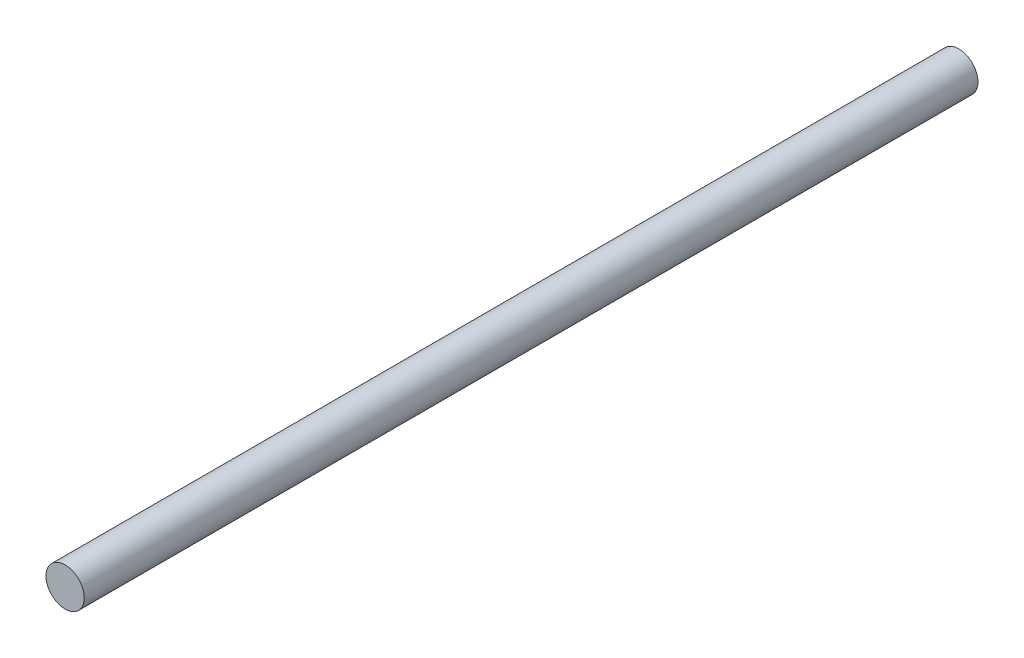
ISO-10303-21;
HEADER;
FILE_DESCRIPTION(('STEP AP214'),'2;1');
FILE_NAME('part.step','',(''),(''),'','','');
FILE_SCHEMA(('AUTOMOTIVE_DESIGN { 1 0 10303 214 1 1 1 1 }'));
ENDSEC;
DATA;
#1=APPLICATION_CONTEXT('core data for automotive mechanical design processes');
#2=APPLICATION_PROTOCOL_DEFINITION('international standard','automotive_design',2000,#1);
#3=PRODUCT_CONTEXT('',#1,'mechanical');
#4=PRODUCT('Part','Part','',(#3));
#5=PRODUCT_RELATED_PRODUCT_CATEGORY('part','',(#4));
#6=PRODUCT_DEFINITION_FORMATION('','',#4);
#7=PRODUCT_DEFINITION_CONTEXT('part definition',#1,'design');
#8=PRODUCT_DEFINITION('design','',#6,#7);
#9=PRODUCT_DEFINITION_SHAPE('','',#8);
#10=(LENGTH_UNIT() NAMED_UNIT(*) SI_UNIT(.MILLI.,.METRE.));
#11=(NAMED_UNIT(*) PLANE_ANGLE_UNIT() SI_UNIT($,.RADIAN.));
#12=(NAMED_UNIT(*) SI_UNIT($,.STERADIAN.) SOLID_ANGLE_UNIT());
#13=UNCERTAINTY_MEASURE_WITH_UNIT(LENGTH_MEASURE(1.E-05),#10,'distance_accuracy_value','');
#14=(GEOMETRIC_REPRESENTATION_CONTEXT(3) GLOBAL_UNCERTAINTY_ASSIGNED_CONTEXT((#13)) GLOBAL_UNIT_ASSIGNED_CONTEXT((#10,
#11,#12)) REPRESENTATION_CONTEXT('',''));
#15=CARTESIAN_POINT('',(0.,0.,0.));
#16=DIRECTION('',(0.,0.,1.));
#17=DIRECTION('',(1.,0.,0.));
#18=AXIS2_PLACEMENT_3D('',#15,#16,#17);
#19=CARTESIAN_POINT('',(0.,0.,350.));
#20=DIRECTION('',(0.,0.,-1.));
#21=DIRECTION('',(-1.,0.,0.));
#22=AXIS2_PLACEMENT_3D('',#19,#20,#21);
#23=CYLINDRICAL_SURFACE('',#22,7.5);
#24=CARTESIAN_POINT('',(0.,0.,350.));
#25=DIRECTION('',(0.,0.,1.));
#26=DIRECTION('',(1.,0.,0.));
#27=AXIS2_PLACEMENT_3D('',#24,#25,#26);
#28=CIRCLE('',#27,7.5);
#29=CARTESIAN_POINT('',(7.5,0.,350.));
#30=VERTEX_POINT('',#29);
#31=EDGE_CURVE('E10',#30,#30,#28,.T.);
#32=ORIENTED_EDGE('',*,*,#31,.F.);
#33=EDGE_LOOP('',(#32));
#34=FACE_BOUND('',#33,.T.);
#35=CARTESIAN_POINT('',(0.,0.,0.));
#36=DIRECTION('',(0.,0.,1.));
#37=DIRECTION('',(1.,0.,0.));
#38=AXIS2_PLACEMENT_3D('',#35,#36,#37);
#39=CIRCLE('',#38,7.5);
#40=CARTESIAN_POINT('',(7.5,0.,0.));
#41=VERTEX_POINT('',#40);
#42=EDGE_CURVE('E34',#41,#41,#39,.T.);
#43=ORIENTED_EDGE('',*,*,#42,.T.);
#44=EDGE_LOOP('',(#43));
#45=FACE_BOUND('',#44,.T.);
#46=ADVANCED_FACE('F31',(#34,#45),#23,.T.);
#47=CARTESIAN_POINT('',(0.,0.,350.));
#48=DIRECTION('',(0.,0.,1.));
#49=DIRECTION('',(1.,0.,0.));
#50=AXIS2_PLACEMENT_3D('',#47,#48,#49);
#51=PLANE('',#50);
#52=ORIENTED_EDGE('',*,*,#31,.T.);
#53=EDGE_LOOP('',(#52));
#54=FACE_BOUND('',#53,.T.);
#55=ADVANCED_FACE('F46',(#54),#51,.T.);
#56=CARTESIAN_POINT('',(0.,0.,0.));
#57=DIRECTION('',(0.,0.,1.));
#58=DIRECTION('',(1.,0.,0.));
#59=AXIS2_PLACEMENT_3D('',#56,#57,#58);
#60=PLANE('',#59);
#61=ORIENTED_EDGE('',*,*,#42,.F.);
#62=EDGE_LOOP('',(#61));
#63=FACE_BOUND('',#62,.T.);
#64=ADVANCED_FACE('F44',(#63),#60,.F.);
#65=CLOSED_SHELL('',(#46,#55,#64));
#66=MANIFOLD_SOLID_BREP('B2',#65);
#67=ADVANCED_BREP_SHAPE_REPRESENTATION('',(#18,#66),#14);
#68=SHAPE_DEFINITION_REPRESENTATION(#9,#67);
ENDSEC;
END-ISO-10303-21;
